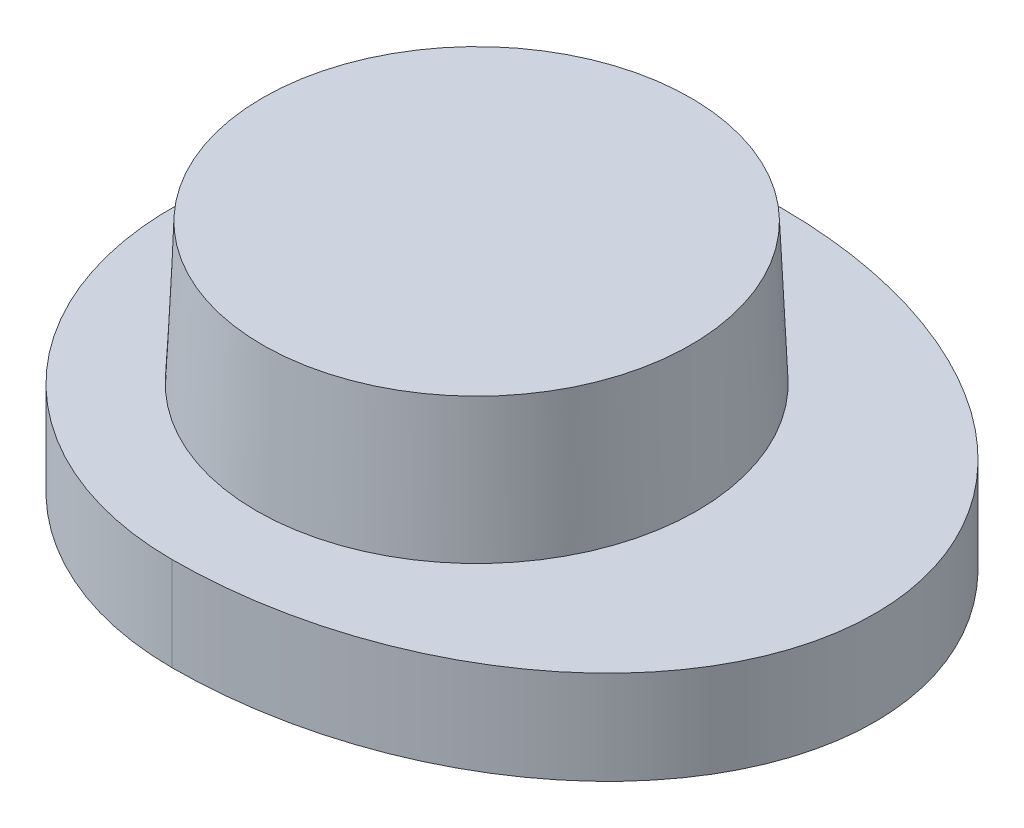
ISO-10303-21;
HEADER;
FILE_DESCRIPTION(('STEP AP214'),'2;1');
FILE_NAME('part.step','',(''),(''),'','','');
FILE_SCHEMA(('AUTOMOTIVE_DESIGN { 1 0 10303 214 1 1 1 1 }'));
ENDSEC;
DATA;
#1=APPLICATION_CONTEXT('core data for automotive mechanical design processes');
#2=APPLICATION_PROTOCOL_DEFINITION('international standard','automotive_design',2000,#1);
#3=PRODUCT_CONTEXT('',#1,'mechanical');
#4=PRODUCT('Part','Part','',(#3));
#5=PRODUCT_RELATED_PRODUCT_CATEGORY('part','',(#4));
#6=PRODUCT_DEFINITION_FORMATION('','',#4);
#7=PRODUCT_DEFINITION_CONTEXT('part definition',#1,'design');
#8=PRODUCT_DEFINITION('design','',#6,#7);
#9=PRODUCT_DEFINITION_SHAPE('','',#8);
#10=(LENGTH_UNIT() NAMED_UNIT(*) SI_UNIT(.MILLI.,.METRE.));
#11=(NAMED_UNIT(*) PLANE_ANGLE_UNIT() SI_UNIT($,.RADIAN.));
#12=(NAMED_UNIT(*) SI_UNIT($,.STERADIAN.) SOLID_ANGLE_UNIT());
#13=UNCERTAINTY_MEASURE_WITH_UNIT(LENGTH_MEASURE(1.E-05),#10,'distance_accuracy_value','');
#14=(GEOMETRIC_REPRESENTATION_CONTEXT(3) GLOBAL_UNCERTAINTY_ASSIGNED_CONTEXT((#13)) GLOBAL_UNIT_ASSIGNED_CONTEXT((#10,
#11,#12)) REPRESENTATION_CONTEXT('',''));
#15=CARTESIAN_POINT('',(0.,0.,0.));
#16=DIRECTION('',(0.,0.,1.));
#17=DIRECTION('',(1.,0.,0.));
#18=AXIS2_PLACEMENT_3D('',#15,#16,#17);
#19=CARTESIAN_POINT('',(0.,1.99996644295302,0.));
#20=DIRECTION('',(0.,1.,0.));
#21=DIRECTION('',(-1.,0.,0.));
#22=AXIS2_PLACEMENT_3D('',#19,#20,#21);
#23=PLANE('',#22);
#24=CARTESIAN_POINT('',(22.,1.99996644295302,0.));
#25=DIRECTION('',(0.,1.,0.));
#26=DIRECTION('',(-1.,0.,0.));
#27=AXIS2_PLACEMENT_3D('',#24,#25,#26);
#28=CIRCLE('',#27,4.);
#29=CARTESIAN_POINT('',(18.,1.99996644295302,0.));
#30=VERTEX_POINT('',#29);
#31=EDGE_CURVE('E11',#30,#30,#28,.T.);
#32=ORIENTED_EDGE('',*,*,#31,.F.);
#33=EDGE_LOOP('',(#32));
#34=FACE_BOUND('',#33,.T.);
#35=ADVANCED_FACE('F42',(#34),#23,.F.);
#36=CARTESIAN_POINT('',(22.,17.9555236403816,0.));
#37=DIRECTION('',(0.,1.,0.));
#38=DIRECTION('',(-1.,0.,0.));
#39=AXIS2_PLACEMENT_3D('',#36,#37,#38);
#40=CYLINDRICAL_SURFACE('',#39,4.);
#41=CARTESIAN_POINT('',(22.,-2.00003355704698,0.));
#42=DIRECTION('',(0.,1.,0.));
#43=DIRECTION('',(-1.,0.,0.));
#44=AXIS2_PLACEMENT_3D('',#41,#42,#43);
#45=CIRCLE('',#44,4.);
#46=CARTESIAN_POINT('',(18.,-2.00003355704698,0.));
#47=VERTEX_POINT('',#46);
#48=EDGE_CURVE('E50',#47,#47,#45,.T.);
#49=ORIENTED_EDGE('',*,*,#48,.F.);
#50=EDGE_LOOP('',(#49));
#51=FACE_BOUND('',#50,.T.);
#52=ORIENTED_EDGE('',*,*,#31,.T.);
#53=EDGE_LOOP('',(#52));
#54=FACE_BOUND('',#53,.T.);
#55=ADVANCED_FACE('F101',(#51,#54),#40,.F.);
#56=CARTESIAN_POINT('',(0.,-2.00003355704698,0.));
#57=DIRECTION('',(0.,1.,0.));
#58=DIRECTION('',(-1.,0.,0.));
#59=AXIS2_PLACEMENT_3D('',#56,#57,#58);
#60=PLANE('',#59);
#61=CARTESIAN_POINT('',(22.,-2.00003355704698,0.));
#62=DIRECTION('',(0.,-1.,0.));
#63=DIRECTION('',(-1.,0.,0.));
#64=AXIS2_PLACEMENT_3D('',#61,#62,#63);
#65=ELLIPSE('',#64,8.5,6.5);
#66=CARTESIAN_POINT('',(22.,-2.00003355704698,-6.5));
#67=VERTEX_POINT('',#66);
#68=CARTESIAN_POINT('',(22.,-2.00003355704698,6.5));
#69=VERTEX_POINT('',#68);
#70=EDGE_CURVE('E57',#67,#69,#65,.T.);
#71=ORIENTED_EDGE('',*,*,#70,.T.);
#72=CARTESIAN_POINT('',(22.,-2.00003355704698,0.));
#73=DIRECTION('',(0.,1.,0.));
#74=DIRECTION('',(-1.,0.,0.));
#75=AXIS2_PLACEMENT_3D('',#72,#73,#74);
#76=CIRCLE('',#75,6.5);
#77=EDGE_CURVE('E86',#67,#69,#76,.T.);
#78=ORIENTED_EDGE('',*,*,#77,.F.);
#79=EDGE_LOOP('',(#71,#78));
#80=FACE_BOUND('',#79,.T.);
#81=ORIENTED_EDGE('',*,*,#48,.T.);
#82=EDGE_LOOP('',(#81));
#83=FACE_BOUND('',#82,.T.);
#84=ADVANCED_FACE('F99',(#80,#83),#60,.F.);
#85=CARTESIAN_POINT('',(22.,17.9555236403816,0.));
#86=DIRECTION('',(0.,1.,0.));
#87=DIRECTION('',(-1.,0.,0.));
#88=AXIS2_PLACEMENT_3D('',#85,#86,#87);
#89=CYLINDRICAL_SURFACE('',#88,6.5);
#90=DIRECTION('',(0.,-1.,0.));
#91=VECTOR('',#90,1.);
#92=CARTESIAN_POINT('',(22.,15.5322245670091,6.5));
#93=LINE('',#92,#91);
#94=CARTESIAN_POINT('',(22.,0.,6.5));
#95=VERTEX_POINT('',#94);
#96=EDGE_CURVE('E63',#95,#69,#93,.T.);
#97=ORIENTED_EDGE('',*,*,#96,.F.);
#98=CARTESIAN_POINT('',(22.,0.,0.));
#99=DIRECTION('',(0.,1.,0.));
#100=DIRECTION('',(-1.,0.,0.));
#101=AXIS2_PLACEMENT_3D('',#98,#99,#100);
#102=CIRCLE('',#101,6.5);
#103=CARTESIAN_POINT('',(22.,0.,-6.5));
#104=VERTEX_POINT('',#103);
#105=EDGE_CURVE('E73',#104,#95,#102,.T.);
#106=ORIENTED_EDGE('',*,*,#105,.F.);
#107=DIRECTION('',(0.,-1.,0.));
#108=VECTOR('',#107,1.);
#109=CARTESIAN_POINT('',(22.,15.5322245670091,-6.5));
#110=LINE('',#109,#108);
#111=EDGE_CURVE('E76',#104,#67,#110,.T.);
#112=ORIENTED_EDGE('',*,*,#111,.T.);
#113=ORIENTED_EDGE('',*,*,#77,.T.);
#114=EDGE_LOOP('',(#97,#106,#112,#113));
#115=FACE_BOUND('',#114,.T.);
#116=ADVANCED_FACE('F84',(#115),#89,.T.);
#117=CARTESIAN_POINT('',(0.,0.,0.));
#118=DIRECTION('',(0.,1.,0.));
#119=DIRECTION('',(-1.,0.,0.));
#120=AXIS2_PLACEMENT_3D('',#117,#118,#119);
#121=PLANE('',#120);
#122=ORIENTED_EDGE('',*,*,#105,.T.);
#123=CARTESIAN_POINT('',(22.,0.,0.));
#124=DIRECTION('',(0.,-1.,0.));
#125=DIRECTION('',(-1.,0.,0.));
#126=AXIS2_PLACEMENT_3D('',#123,#124,#125);
#127=ELLIPSE('',#126,8.5,6.5);
#128=EDGE_CURVE('E69',#104,#95,#127,.T.);
#129=ORIENTED_EDGE('',*,*,#128,.F.);
#130=EDGE_LOOP('',(#122,#129));
#131=FACE_BOUND('',#130,.T.);
#132=CARTESIAN_POINT('',(22.,0.,0.));
#133=DIRECTION('',(0.,1.,0.));
#134=DIRECTION('',(-1.,0.,0.));
#135=AXIS2_PLACEMENT_3D('',#132,#133,#134);
#136=CIRCLE('',#135,4.7);
#137=CARTESIAN_POINT('',(17.3,0.,0.));
#138=VERTEX_POINT('',#137);
#139=EDGE_CURVE('E87',#138,#138,#136,.T.);
#140=ORIENTED_EDGE('',*,*,#139,.F.);
#141=EDGE_LOOP('',(#140));
#142=FACE_BOUND('',#141,.T.);
#143=ADVANCED_FACE('F70',(#131,#142),#121,.T.);
#144=CARTESIAN_POINT('',(22.,2.99996644295302,0.));
#145=DIRECTION('',(0.,-1.,0.));
#146=DIRECTION('',(1.,0.,0.));
#147=AXIS2_PLACEMENT_3D('',#144,#145,#146);
#148=CONICAL_SURFACE('',#147,4.5690186364068,0.0436332312998501);
#149=ORIENTED_EDGE('',*,*,#139,.T.);
#150=EDGE_LOOP('',(#149));
#151=FACE_BOUND('',#150,.T.);
#152=CARTESIAN_POINT('',(22.,2.99996644295302,0.));
#153=DIRECTION('',(0.,1.,0.));
#154=DIRECTION('',(-1.,0.,0.));
#155=AXIS2_PLACEMENT_3D('',#152,#153,#154);
#156=CIRCLE('',#155,4.5690186364068);
#157=CARTESIAN_POINT('',(17.4309813635932,2.99996644295302,0.));
#158=VERTEX_POINT('',#157);
#159=EDGE_CURVE('E82',#158,#158,#156,.T.);
#160=ORIENTED_EDGE('',*,*,#159,.F.);
#161=EDGE_LOOP('',(#160));
#162=FACE_BOUND('',#161,.T.);
#163=ADVANCED_FACE('F133',(#151,#162),#148,.T.);
#164=CARTESIAN_POINT('',(0.,2.99996644295302,0.));
#165=DIRECTION('',(0.,-1.,0.));
#166=DIRECTION('',(1.,0.,0.));
#167=AXIS2_PLACEMENT_3D('',#164,#165,#166);
#168=PLANE('',#167);
#169=ORIENTED_EDGE('',*,*,#159,.T.);
#170=EDGE_LOOP('',(#169));
#171=FACE_BOUND('',#170,.T.);
#172=ADVANCED_FACE('F140',(#171),#168,.F.);
#173=CARTESIAN_POINT('',(22.,15.5322245670091,0.));
#174=DIRECTION('',(0.,-1.,0.));
#175=DIRECTION('',(-1.,0.,0.));
#176=AXIS2_PLACEMENT_3D('',#173,#174,#175);
#177=ELLIPSE('',#176,8.5,6.5);
#178=DIRECTION('',(0.,-1.,0.));
#179=VECTOR('',#178,1.);
#180=SURFACE_OF_LINEAR_EXTRUSION('',#177,#179);
#181=ORIENTED_EDGE('',*,*,#111,.F.);
#182=ORIENTED_EDGE('',*,*,#128,.T.);
#183=ORIENTED_EDGE('',*,*,#96,.T.);
#184=ORIENTED_EDGE('',*,*,#70,.F.);
#185=EDGE_LOOP('',(#181,#182,#183,#184));
#186=FACE_BOUND('',#185,.T.);
#187=ADVANCED_FACE('F77',(#186),#180,.T.);
#188=CLOSED_SHELL('',(#35,#55,#84,#116,#143,#163,#172,#187));
#189=MANIFOLD_SOLID_BREP('B2',#188);
#190=ADVANCED_BREP_SHAPE_REPRESENTATION('',(#18,#189),#14);
#191=SHAPE_DEFINITION_REPRESENTATION(#9,#190);
ENDSEC;
END-ISO-10303-21;
